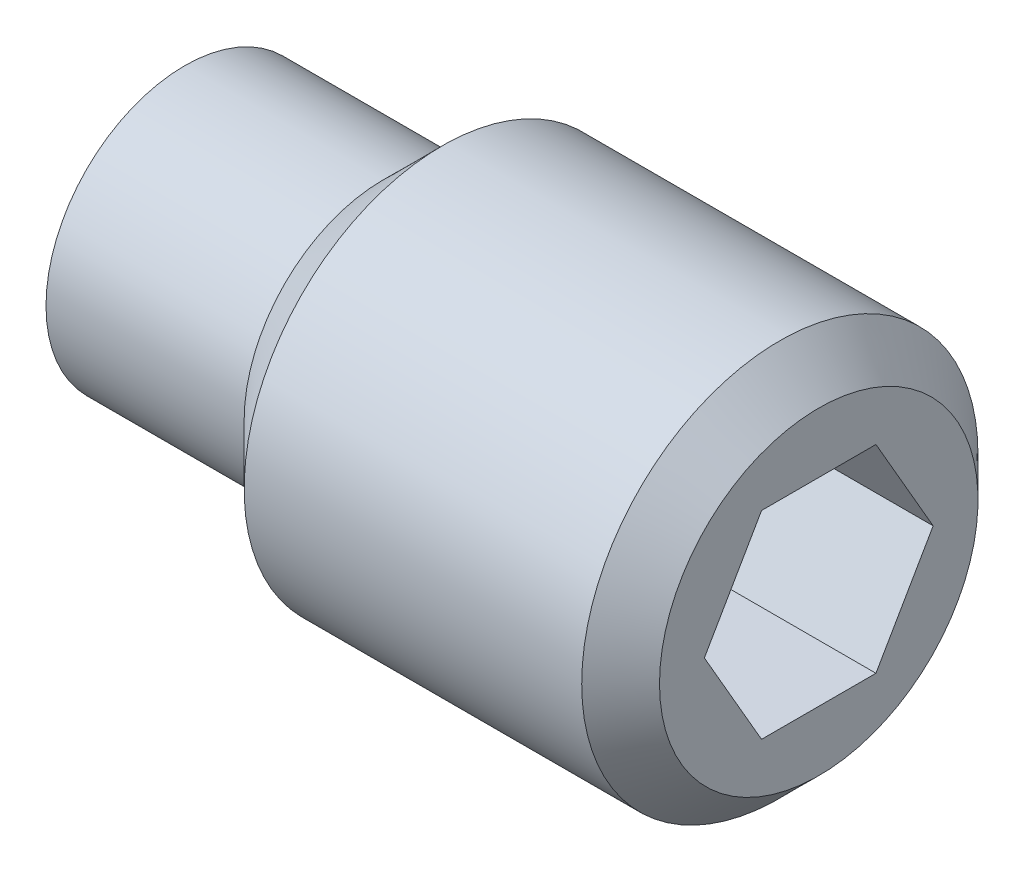
ISO-10303-21;
HEADER;
FILE_DESCRIPTION(('STEP AP214'),'2;1');
FILE_NAME('part.step','',(''),(''),'','','');
FILE_SCHEMA(('AUTOMOTIVE_DESIGN { 1 0 10303 214 1 1 1 1 }'));
ENDSEC;
DATA;
#1=APPLICATION_CONTEXT('core data for automotive mechanical design processes');
#2=APPLICATION_PROTOCOL_DEFINITION('international standard','automotive_design',2000,#1);
#3=PRODUCT_CONTEXT('',#1,'mechanical');
#4=PRODUCT('Part','Part','',(#3));
#5=PRODUCT_RELATED_PRODUCT_CATEGORY('part','',(#4));
#6=PRODUCT_DEFINITION_FORMATION('','',#4);
#7=PRODUCT_DEFINITION_CONTEXT('part definition',#1,'design');
#8=PRODUCT_DEFINITION('design','',#6,#7);
#9=PRODUCT_DEFINITION_SHAPE('','',#8);
#10=(LENGTH_UNIT() NAMED_UNIT(*) SI_UNIT(.MILLI.,.METRE.));
#11=(NAMED_UNIT(*) PLANE_ANGLE_UNIT() SI_UNIT($,.RADIAN.));
#12=(NAMED_UNIT(*) SI_UNIT($,.STERADIAN.) SOLID_ANGLE_UNIT());
#13=UNCERTAINTY_MEASURE_WITH_UNIT(LENGTH_MEASURE(1.E-05),#10,'distance_accuracy_value','');
#14=(GEOMETRIC_REPRESENTATION_CONTEXT(3) GLOBAL_UNCERTAINTY_ASSIGNED_CONTEXT((#13)) GLOBAL_UNIT_ASSIGNED_CONTEXT((#10,
#11,#12)) REPRESENTATION_CONTEXT('',''));
#15=CARTESIAN_POINT('',(0.,0.,0.));
#16=DIRECTION('',(0.,0.,1.));
#17=DIRECTION('',(1.,0.,0.));
#18=AXIS2_PLACEMENT_3D('',#15,#16,#17);
#19=CARTESIAN_POINT('',(8.,-1.25,0.721687836487));
#20=DIRECTION('',(0.,-1.,0.));
#21=DIRECTION('',(0.,0.,-1.));
#22=AXIS2_PLACEMENT_3D('',#19,#20,#21);
#23=PLANE('',#22);
#24=CARTESIAN_POINT('',(5.00000000001904,-1.25,0.721687836479526));
#25=CARTESIAN_POINT('',(4.98289611115972,-1.24999999474163,0.662444421513435));
#26=CARTESIAN_POINT('',(4.96723701410208,-1.2499999973679,0.602732338649849));
#27=CARTESIAN_POINT('',(4.93956150219575,-1.25000000263793,0.482338189538206));
#28=CARTESIAN_POINT('',(4.9275532377462,-1.2500000052817,0.421654266781865));
#29=CARTESIAN_POINT('',(4.90824250364097,-1.24999999484114,0.300967350633981));
#30=CARTESIAN_POINT('',(4.90083707686526,-1.2499999821212,0.240981349023029));
#31=CARTESIAN_POINT('',(4.89089570036484,-1.25000001785936,0.120663266810707));
#32=CARTESIAN_POINT('',(4.88835446491729,-1.25000006625096,0.0603316334074688));
#33=CARTESIAN_POINT('',(4.88835446491709,-1.25000006625096,-0.0603316333998728));
#34=CARTESIAN_POINT('',(4.8908957003645,-1.25000001785936,-0.120663266803977));
#35=CARTESIAN_POINT('',(4.90083707686463,-1.2499999821212,-0.240981349018096));
#36=CARTESIAN_POINT('',(4.90824250364019,-1.24999999484114,-0.300967350629978));
#37=CARTESIAN_POINT('',(4.92755323774597,-1.2500000052817,-0.421654266779554));
#38=CARTESIAN_POINT('',(4.93956150219624,-1.25000000263793,-0.482338189536651));
#39=CARTESIAN_POINT('',(4.96723701410138,-1.2499999973679,-0.60273233865044));
#40=CARTESIAN_POINT('',(4.98289611115711,-1.24999999474163,-0.662444421515415));
#41=CARTESIAN_POINT('',(5.0000000000115,-1.25,-0.721687836483682));
#42=B_SPLINE_CURVE_WITH_KNOTS('',3,(#24,#25,#26,#27,#28,#29,#30,#31,#32,#33,#34,#35,#36,#37,#38,
#39,#40,#41),.UNSPECIFIED.,.F.,.F.,(4,2,2,2,2,2,2,2,4),(0.,0.185045871712566,0.370501870824418,
0.551644291487993,0.732589759905811,0.913535228326233,1.09467764899245,1.28013364810704,
1.4651795198222),.UNSPECIFIED.);
#43=CARTESIAN_POINT('',(5.00000000001842,-1.24999999999682,0.7216878364829));
#44=VERTEX_POINT('',#43);
#45=CARTESIAN_POINT('',(5.00000000001198,-1.25,-0.721687836485341));
#46=VERTEX_POINT('',#45);
#47=EDGE_CURVE('E21',#44,#46,#42,.T.);
#48=ORIENTED_EDGE('',*,*,#47,.F.);
#49=DIRECTION('',(1.,0.,0.));
#50=VECTOR('',#49,1.);
#51=CARTESIAN_POINT('',(8.,-1.2499999999981,0.721687836483704));
#52=LINE('',#51,#50);
#53=CARTESIAN_POINT('',(8.,-1.24999999999873,0.721687836484802));
#54=VERTEX_POINT('',#53);
#55=EDGE_CURVE('E85',#44,#54,#52,.T.);
#56=ORIENTED_EDGE('',*,*,#55,.T.);
#57=DIRECTION('',(0.,0.,-1.));
#58=VECTOR('',#57,1.);
#59=CARTESIAN_POINT('',(8.,-1.25,0.721687836487));
#60=LINE('',#59,#58);
#61=CARTESIAN_POINT('',(8.,-1.25,-0.721687836487));
#62=VERTEX_POINT('',#61);
#63=EDGE_CURVE('E86',#62,#54,#60,.F.);
#64=ORIENTED_EDGE('',*,*,#63,.F.);
#65=DIRECTION('',(1.,0.,0.));
#66=VECTOR('',#65,1.);
#67=CARTESIAN_POINT('',(8.,-1.25,-0.721687836487));
#68=LINE('',#67,#66);
#69=EDGE_CURVE('E89',#62,#46,#68,.F.);
#70=ORIENTED_EDGE('',*,*,#69,.T.);
#71=EDGE_LOOP('',(#48,#56,#64,#70));
#72=FACE_BOUND('',#71,.T.);
#73=ADVANCED_FACE('F17',(#72),#23,.F.);
#74=CARTESIAN_POINT('',(8.,0.,1.44337567297));
#75=DIRECTION('',(0.,-0.50000000000019,0.866025403784329));
#76=DIRECTION('',(0.,-0.866025403784329,-0.50000000000019));
#77=AXIS2_PLACEMENT_3D('',#74,#75,#76);
#78=PLANE('',#77);
#79=DIRECTION('',(1.,0.,0.));
#80=VECTOR('',#79,1.);
#81=CARTESIAN_POINT('',(8.,1.90060640836709E-12,1.4433756729733));
#82=LINE('',#81,#80);
#83=CARTESIAN_POINT('',(5.00000000001857,-2.78732666403681E-12,1.44337567296949));
#84=VERTEX_POINT('',#83);
#85=CARTESIAN_POINT('',(8.,1.26558326683197E-12,1.4433756729722));
#86=VERTEX_POINT('',#85);
#87=EDGE_CURVE('E97',#84,#86,#82,.T.);
#88=ORIENTED_EDGE('',*,*,#87,.T.);
#89=DIRECTION('',(0.,-0.866025403784329,-0.50000000000019));
#90=VECTOR('',#89,1.);
#91=CARTESIAN_POINT('',(8.,0.,1.44337567297));
#92=LINE('',#91,#90);
#93=EDGE_CURVE('E202',#54,#86,#92,.F.);
#94=ORIENTED_EDGE('',*,*,#93,.F.);
#95=ORIENTED_EDGE('',*,*,#55,.F.);
#96=CARTESIAN_POINT('',(5.00000000001588,-7.75612856317836E-12,1.44337567296645));
#97=CARTESIAN_POINT('',(4.98168471572059,-0.0549299297341489,1.41166186325174));
#98=CARTESIAN_POINT('',(4.96502792320445,-0.110334013832605,1.37967430038303));
#99=CARTESIAN_POINT('',(4.93595399214256,-0.222101466684948,1.31514533139188));
#100=CARTESIAN_POINT('',(4.92354713772891,-0.278466820683721,1.28260277908777));
#101=CARTESIAN_POINT('',(4.90423497435936,-0.390499021104487,1.21792095801695));
#102=CARTESIAN_POINT('',(4.89720111726636,-0.446148634765127,1.18579163858965));
#103=CARTESIAN_POINT('',(4.88880573010025,-0.557709575292939,1.12138189954482));
#104=CARTESIAN_POINT('',(4.88743724625279,-0.613620496944659,1.08910171387855));
#105=CARTESIAN_POINT('',(4.89029143136597,-0.718084056071275,1.02878964989626));
#106=CARTESIAN_POINT('',(4.89381330327945,-0.766652369154264,1.0007487212637));
#107=CARTESIAN_POINT('',(4.90497331296815,-0.863472588603186,0.944849541501837));
#108=CARTESIAN_POINT('',(4.91261525924967,-0.91172416034378,0.916991483568569));
#109=CARTESIAN_POINT('',(4.93171864585547,-1.0087438385756,0.860977146224707));
#110=CARTESIAN_POINT('',(4.94326102640528,-1.05749967211165,0.832827952608094));
#111=CARTESIAN_POINT('',(4.96945735054298,-1.15428435624833,0.776949289168319));
#112=CARTESIAN_POINT('',(4.98410514298824,-1.20231444581616,0.749219104027117));
#113=CARTESIAN_POINT('',(5.00000000001781,-1.24999999999364,0.721687836486274));
#114=B_SPLINE_CURVE_WITH_KNOTS('',3,(#96,#97,#98,#99,#100,#101,#102,#103,#104,#105,#106,#107,
#108,#109,#110,#111,#112,#113),.UNSPECIFIED.,.F.,.F.,(4,2,2,2,2,2,2,2,4),(0.,0.198135007221789,
0.396746135639453,0.590442253841928,0.783900555556332,0.952317364137337,1.12089012111111,
1.29320101404209,1.4651737334306),.UNSPECIFIED.);
#115=EDGE_CURVE('E81',#84,#44,#114,.T.);
#116=ORIENTED_EDGE('',*,*,#115,.F.);
#117=EDGE_LOOP('',(#88,#94,#95,#116));
#118=FACE_BOUND('',#117,.T.);
#119=ADVANCED_FACE('F240',(#118),#78,.F.);
#120=CARTESIAN_POINT('',(8.,-1.25,-0.721687836487));
#121=DIRECTION('',(0.,-0.50000000000019,-0.866025403784329));
#122=DIRECTION('',(0.,0.866025403784329,-0.50000000000019));
#123=AXIS2_PLACEMENT_3D('',#120,#121,#122);
#124=PLANE('',#123);
#125=ORIENTED_EDGE('',*,*,#69,.F.);
#126=DIRECTION('',(0.,0.866025403784329,-0.50000000000019));
#127=VECTOR('',#126,1.);
#128=CARTESIAN_POINT('',(8.,-1.25,-0.721687836487));
#129=LINE('',#128,#127);
#130=CARTESIAN_POINT('',(8.,5.94495953870982E-11,-1.44337567295029));
#131=VERTEX_POINT('',#130);
#132=EDGE_CURVE('E92',#131,#62,#129,.F.);
#133=ORIENTED_EDGE('',*,*,#132,.F.);
#134=DIRECTION('',(1.,0.,0.));
#135=VECTOR('',#134,1.);
#136=CARTESIAN_POINT('',(8.,7.21007828594992E-11,-1.44337567292837));
#137=LINE('',#136,#135);
#138=CARTESIAN_POINT('',(4.99999999615965,-1.14831157136668E-08,-1.44337566630079));
#139=VERTEX_POINT('',#138);
#140=EDGE_CURVE('E95',#131,#139,#137,.F.);
#141=ORIENTED_EDGE('',*,*,#140,.T.);
#142=CARTESIAN_POINT('',(5.0000000000115,-1.24999999999713,-0.72168783648866));
#143=CARTESIAN_POINT('',(4.98168471571867,-1.19507007027865,-0.753401646198206));
#144=CARTESIAN_POINT('',(4.96502792320468,-1.13966598618833,-0.785389209061972));
#145=CARTESIAN_POINT('',(4.9359539921461,-1.02789853335369,-0.849918178042721));
#146=CARTESIAN_POINT('',(4.9235471377335,-0.971533179364507,-0.882460730341363));
#147=CARTESIAN_POINT('',(4.90423497436065,-0.859500978944825,-0.947142551411605));
#148=CARTESIAN_POINT('',(4.897201117265,-0.803851365275455,-0.97927187084393));
#149=CARTESIAN_POINT('',(4.88880573009561,-0.692290424728642,-1.04368160989971));
#150=CARTESIAN_POINT('',(4.88743724624761,-0.636379503066647,-1.07596179557192));
#151=CARTESIAN_POINT('',(4.89029143130092,-0.531915946094037,-1.1362738583106));
#152=CARTESIAN_POINT('',(4.89381330295911,-0.48334763517069,-1.16431478569629));
#153=CARTESIAN_POINT('',(4.90497331178614,-0.386527420005154,-1.22021396298514));
#154=CARTESIAN_POINT('',(4.91261525746046,-0.338275850388219,-1.24807201969231));
#155=CARTESIAN_POINT('',(4.93171864255231,-0.241256176452876,-1.3040863545556));
#156=CARTESIAN_POINT('',(4.94326102218439,-0.192500345087545,-1.33223554691895));
#157=CARTESIAN_POINT('',(4.96945734428709,-0.0957156652132834,-1.38811420789782));
#158=CARTESIAN_POINT('',(4.98410513561629,-0.0476855777374497,-1.4158443918312));
#159=CARTESIAN_POINT('',(4.99999999147179,-2.56226147036494E-08,-1.44337565818117));
#160=B_SPLINE_CURVE_WITH_KNOTS('',3,(#142,#143,#144,#145,#146,#147,#148,#149,#150,#151,#152,
#153,#154,#155,#156,#157,#158,#159),.UNSPECIFIED.,.F.,.F.,(4,2,2,2,2,2,2,2,4),(0.,
0.198135007192567,0.396746135577147,0.590442253810806,0.783900555559192,0.952317356648343,
1.12089010610254,1.29320099112337,1.46517370266198),.UNSPECIFIED.);
#161=EDGE_CURVE('E79',#46,#139,#160,.T.);
#162=ORIENTED_EDGE('',*,*,#161,.F.);
#163=EDGE_LOOP('',(#125,#133,#141,#162));
#164=FACE_BOUND('',#163,.T.);
#165=ADVANCED_FACE('F94',(#164),#124,.F.);
#166=CARTESIAN_POINT('',(8.,1.25,0.721687836487));
#167=DIRECTION('',(0.,0.50000000000019,0.866025403784329));
#168=DIRECTION('',(0.,-0.866025403784329,0.50000000000019));
#169=AXIS2_PLACEMENT_3D('',#166,#167,#168);
#170=PLANE('',#169);
#171=DIRECTION('',(1.,0.,0.));
#172=VECTOR('',#171,1.);
#173=CARTESIAN_POINT('',(8.,1.25,0.721687836487));
#174=LINE('',#173,#172);
#175=CARTESIAN_POINT('',(4.99999999232941,1.24999996249412,0.721687874803954));
#176=VERTEX_POINT('',#175);
#177=CARTESIAN_POINT('',(8.,1.25000000007187,0.721687836459937));
#178=VERTEX_POINT('',#177);
#179=EDGE_CURVE('E136',#176,#178,#174,.T.);
#180=ORIENTED_EDGE('',*,*,#179,.T.);
#181=DIRECTION('',(0.,-0.866025403784329,0.50000000000019));
#182=VECTOR('',#181,1.);
#183=CARTESIAN_POINT('',(8.,1.25,0.721687836487));
#184=LINE('',#183,#182);
#185=EDGE_CURVE('E100',#86,#178,#184,.F.);
#186=ORIENTED_EDGE('',*,*,#185,.F.);
#187=ORIENTED_EDGE('',*,*,#87,.F.);
#188=CARTESIAN_POINT('',(5.00000000001821,1.06156038532429E-11,1.44337567296744));
#189=CARTESIAN_POINT('',(4.98168471573036,0.0549299297131753,1.41166186326761));
#190=CARTESIAN_POINT('',(4.96502792322067,0.110334013787289,1.37967430041342));
#191=CARTESIAN_POINT('',(4.93595399216867,0.222101466586891,1.31514533145306));
#192=CARTESIAN_POINT('',(4.92354713775819,0.278466820557217,1.28260277916525));
#193=CARTESIAN_POINT('',(4.90423497437942,0.390499020973991,1.21792095809664));
#194=CARTESIAN_POINT('',(4.89720111727898,0.446148634659747,1.18579163865487));
#195=CARTESIAN_POINT('',(4.88880573010404,0.557709575242294,1.12138189957847));
#196=CARTESIAN_POINT('',(4.88743724625542,0.613620496923643,1.08910171389508));
#197=CARTESIAN_POINT('',(4.89029143119425,0.71808404974184,1.02878965355496));
#198=CARTESIAN_POINT('',(4.89381330236064,0.766652356500373,1.00074872857382));
#199=CARTESIAN_POINT('',(4.90497330952715,0.863472563405467,0.944849556054143));
#200=CARTESIAN_POINT('',(4.91261525403113,0.911724128926938,0.916991501711486));
#201=CARTESIAN_POINT('',(4.93171863620473,1.00874379457656,0.860977171631959));
#202=CARTESIAN_POINT('',(4.94326101406775,1.05749962175571,0.832827981685504));
#203=CARTESIAN_POINT('',(4.96945733224751,1.15428429340989,0.776949325452503));
#204=CARTESIAN_POINT('',(4.98410512142518,1.20231437685128,0.749219143848402));
#205=CARTESIAN_POINT('',(4.99999997501728,1.24999992498824,0.721687879795058));
#206=B_SPLINE_CURVE_WITH_KNOTS('',3,(#188,#189,#190,#191,#192,#193,#194,#195,#196,#197,#198,
#199,#200,#201,#202,#203,#204,#205),.UNSPECIFIED.,.F.,.F.,(4,2,2,2,2,2,2,2,4),(0.,
0.198135007134762,0.39674613545411,0.590442253746268,0.783900555558537,0.952317342199931,
1.12089007715292,1.29320094691959,1.46517364332018),.UNSPECIFIED.);
#207=EDGE_CURVE('E131',#84,#176,#206,.T.);
#208=ORIENTED_EDGE('',*,*,#207,.T.);
#209=EDGE_LOOP('',(#180,#186,#187,#208));
#210=FACE_BOUND('',#209,.T.);
#211=ADVANCED_FACE('F127',(#210),#170,.F.);
#212=CARTESIAN_POINT('',(8.,0.,-1.44337567297));
#213=DIRECTION('',(0.,0.50000000000019,-0.866025403784329));
#214=DIRECTION('',(0.,0.866025403784329,0.50000000000019));
#215=AXIS2_PLACEMENT_3D('',#212,#213,#214);
#216=PLANE('',#215);
#217=ORIENTED_EDGE('',*,*,#140,.F.);
#218=DIRECTION('',(0.,0.866025403784329,0.50000000000019));
#219=VECTOR('',#218,1.);
#220=CARTESIAN_POINT('',(8.,0.,-1.44337567297));
#221=LINE('',#220,#219);
#222=CARTESIAN_POINT('',(8.,1.25000000006163,-0.721687836422151));
#223=VERTEX_POINT('',#222);
#224=EDGE_CURVE('E40',#223,#131,#221,.F.);
#225=ORIENTED_EDGE('',*,*,#224,.F.);
#226=DIRECTION('',(1.,0.,0.));
#227=VECTOR('',#226,1.);
#228=CARTESIAN_POINT('',(8.,1.25,-0.721687836402));
#229=LINE('',#228,#227);
#230=CARTESIAN_POINT('',(5.00000000001145,1.2500000000357,-0.72168783642169));
#231=VERTEX_POINT('',#230);
#232=EDGE_CURVE('E145',#223,#231,#229,.F.);
#233=ORIENTED_EDGE('',*,*,#232,.T.);
#234=CARTESIAN_POINT('',(5.00000000003499,1.2500000000714,-0.72168783644138));
#235=CARTESIAN_POINT('',(4.98168471573981,1.19507007035099,-0.753401646152046));
#236=CARTESIAN_POINT('',(4.9650279232234,1.13966598625871,-0.785389209016942));
#237=CARTESIAN_POINT('',(4.93595399215986,1.02789853341991,-0.849918178000095));
#238=CARTESIAN_POINT('',(4.92354713774477,0.971533179428513,-0.882460730300013));
#239=CARTESIAN_POINT('',(4.90423497436746,0.859500979006175,-0.947142551371789));
#240=CARTESIAN_POINT('',(4.89720111726968,0.803851365336389,-0.979271870804355));
#241=CARTESIAN_POINT('',(4.88880573009597,0.692290424788727,-1.04368160986063));
#242=CARTESIAN_POINT('',(4.88743724624577,0.6363795031263,-1.07596179553309));
#243=CARTESIAN_POINT('',(4.89029143130119,0.531915945936646,-1.13627385839707));
#244=CARTESIAN_POINT('',(4.89381330298312,0.483347634797166,-1.16431478590755));
#245=CARTESIAN_POINT('',(4.90497331189292,0.386527419202858,-1.22021396344395));
#246=CARTESIAN_POINT('',(4.91261525762635,0.338275849373291,-1.24807202027388));
#247=CARTESIAN_POINT('',(4.93171864286662,0.241256175007699,-1.30408635538558));
#248=CARTESIAN_POINT('',(4.9432610225891,0.192500343424961,-1.33223554787445));
#249=CARTESIAN_POINT('',(4.96945734489283,0.0957156631237688,-1.3881142090998));
#250=CARTESIAN_POINT('',(4.98410513633254,0.0476855754383835,-1.41584439315418));
#251=CARTESIAN_POINT('',(4.99999999230447,2.31169454011823E-08,-1.44337565962343));
#252=B_SPLINE_CURVE_WITH_KNOTS('',3,(#234,#235,#236,#237,#238,#239,#240,#241,#242,#243,#244,
#245,#246,#247,#248,#249,#250,#251),.UNSPECIFIED.,.F.,.F.,(4,2,2,2,2,2,2,2,4),(0.,
0.198135007200973,0.396746135594491,0.590442253830258,0.783900555580421,0.952317357418995,
1.12089010762539,1.29320099343754,1.46517370576145),.UNSPECIFIED.);
#253=EDGE_CURVE('E107',#231,#139,#252,.T.);
#254=ORIENTED_EDGE('',*,*,#253,.T.);
#255=EDGE_LOOP('',(#217,#225,#233,#254));
#256=FACE_BOUND('',#255,.T.);
#257=ADVANCED_FACE('F122',(#256),#216,.F.);
#258=CARTESIAN_POINT('',(5.00499999998283,0.,0.));
#259=DIRECTION('',(1.,0.,0.));
#260=DIRECTION('',(0.,0.,-1.));
#261=AXIS2_PLACEMENT_3D('',#258,#259,#260);
#262=CONICAL_SURFACE('',#261,1.45203592694543,1.04719755119609);
#263=CARTESIAN_POINT('',(4.16666666671972,-5.6843418860808E-11,0.));
#264=VERTEX_POINT('',#263);
#265=VERTEX_LOOP('',#264);
#266=FACE_BOUND('',#265,.T.);
#267=ORIENTED_EDGE('',*,*,#207,.F.);
#268=ORIENTED_EDGE('',*,*,#115,.T.);
#269=ORIENTED_EDGE('',*,*,#47,.T.);
#270=ORIENTED_EDGE('',*,*,#161,.T.);
#271=ORIENTED_EDGE('',*,*,#253,.F.);
#272=CARTESIAN_POINT('',(4.99999999998868,1.25,-0.721687836404651));
#273=CARTESIAN_POINT('',(4.98289611114084,1.24999999474137,-0.662444421434606));
#274=CARTESIAN_POINT('',(4.96723701408848,1.24999999736777,-0.602732338568687));
#275=CARTESIAN_POINT('',(4.93956150218743,1.25000000263806,-0.482338189452175));
#276=CARTESIAN_POINT('',(4.92755323773796,1.25000000528197,-0.421654266693278));
#277=CARTESIAN_POINT('',(4.9082425036384,1.24999999484089,-0.300967350556852));
#278=CARTESIAN_POINT('',(4.90083707686699,1.24999998212031,-0.240981348960126));
#279=CARTESIAN_POINT('',(4.89089570037052,1.25000001786024,-0.120663266778309));
#280=CARTESIAN_POINT('',(4.88835446492254,1.25000006625424,-0.0603316333913596));
#281=CARTESIAN_POINT('',(4.8883544649232,1.25000006625424,0.0603316356578453));
#282=CARTESIAN_POINT('',(4.89089570056336,1.25000001786024,0.1206632713201));
#283=CARTESIAN_POINT('',(4.90083707779799,1.24999998212031,0.240981358014556));
#284=CARTESIAN_POINT('',(4.90824250511628,1.24999999484089,0.300967361848523));
#285=CARTESIAN_POINT('',(4.92755324060414,1.25000000528196,0.421654282498194));
#286=CARTESIAN_POINT('',(4.93956150590561,1.25000000263806,0.482338207530739));
#287=CARTESIAN_POINT('',(4.96723701970606,1.24999999736777,0.602732361103648));
#288=CARTESIAN_POINT('',(4.98289611780452,1.24999999474137,0.662444446152669));
#289=CARTESIAN_POINT('',(5.0000000077532,1.25,0.721687863271447));
#290=B_SPLINE_CURVE_WITH_KNOTS('',3,(#272,#273,#274,#275,#276,#277,#278,#279,#280,#281,#282,
#283,#284,#285,#286,#287,#288,#289),.UNSPECIFIED.,.F.,.F.,(4,2,2,2,2,2,2,2,4),(0.,
0.185045871715306,0.370501870834809,0.551644291454247,0.732589759824679,0.913535235013019,
1.09467766247698,1.280133668774,1.46517954760778),.UNSPECIFIED.);
#291=EDGE_CURVE('E137',#231,#176,#290,.T.);
#292=ORIENTED_EDGE('',*,*,#291,.T.);
#293=EDGE_LOOP('',(#267,#268,#269,#270,#271,#292));
#294=FACE_BOUND('',#293,.T.);
#295=ADVANCED_FACE('F76',(#266,#294),#262,.F.);
#296=CARTESIAN_POINT('',(0.,0.875,0.));
#297=DIRECTION('',(-1.,0.,0.));
#298=DIRECTION('',(0.,-1.,0.));
#299=AXIS2_PLACEMENT_3D('',#296,#297,#298);
#300=PLANE('',#299);
#301=CARTESIAN_POINT('',(0.,0.,0.));
#302=DIRECTION('',(1.,0.,0.));
#303=DIRECTION('',(0.,0.,-1.));
#304=AXIS2_PLACEMENT_3D('',#301,#302,#303);
#305=CIRCLE('',#304,1.75);
#306=CARTESIAN_POINT('',(0.,0.,-1.75));
#307=VERTEX_POINT('',#306);
#308=EDGE_CURVE('E144',#307,#307,#305,.T.);
#309=ORIENTED_EDGE('',*,*,#308,.F.);
#310=EDGE_LOOP('',(#309));
#311=FACE_BOUND('',#310,.T.);
#312=ADVANCED_FACE('F152',(#311),#300,.T.);
#313=CARTESIAN_POINT('',(8.,1.25,-0.721687836487));
#314=DIRECTION('',(0.,1.,0.));
#315=DIRECTION('',(0.,0.,1.));
#316=AXIS2_PLACEMENT_3D('',#313,#314,#315);
#317=PLANE('',#316);
#318=ORIENTED_EDGE('',*,*,#291,.F.);
#319=ORIENTED_EDGE('',*,*,#232,.F.);
#320=DIRECTION('',(0.,0.,1.));
#321=VECTOR('',#320,1.);
#322=CARTESIAN_POINT('',(8.,1.25000000015,0.));
#323=LINE('',#322,#321);
#324=EDGE_CURVE('E194',#223,#178,#323,.T.);
#325=ORIENTED_EDGE('',*,*,#324,.T.);
#326=ORIENTED_EDGE('',*,*,#179,.F.);
#327=EDGE_LOOP('',(#318,#319,#325,#326));
#328=FACE_BOUND('',#327,.T.);
#329=ADVANCED_FACE('F147',(#328),#317,.F.);
#330=CARTESIAN_POINT('',(1.25,0.,0.));
#331=DIRECTION('',(1.,0.,0.));
#332=DIRECTION('',(0.,0.,-1.));
#333=AXIS2_PLACEMENT_3D('',#330,#331,#332);
#334=CYLINDRICAL_SURFACE('',#333,1.75);
#335=ORIENTED_EDGE('',*,*,#308,.T.);
#336=EDGE_LOOP('',(#335));
#337=FACE_BOUND('',#336,.T.);
#338=CARTESIAN_POINT('',(2.49999999999773,0.,0.));
#339=DIRECTION('',(1.,0.,0.));
#340=DIRECTION('',(0.,-1.,0.));
#341=AXIS2_PLACEMENT_3D('',#338,#339,#340);
#342=CIRCLE('',#341,1.75000000001546);
#343=CARTESIAN_POINT('',(2.49999999999773,-1.75000000001546,0.));
#344=VERTEX_POINT('',#343);
#345=EDGE_CURVE('E191',#344,#344,#342,.T.);
#346=ORIENTED_EDGE('',*,*,#345,.F.);
#347=EDGE_LOOP('',(#346));
#348=FACE_BOUND('',#347,.T.);
#349=ADVANCED_FACE('F151',(#337,#348),#334,.T.);
#350=CARTESIAN_POINT('',(8.,0.,0.));
#351=DIRECTION('',(-1.,0.,0.));
#352=DIRECTION('',(0.,-1.,0.));
#353=AXIS2_PLACEMENT_3D('',#350,#351,#352);
#354=PLANE('',#353);
#355=ORIENTED_EDGE('',*,*,#224,.T.);
#356=ORIENTED_EDGE('',*,*,#132,.T.);
#357=ORIENTED_EDGE('',*,*,#63,.T.);
#358=ORIENTED_EDGE('',*,*,#93,.T.);
#359=ORIENTED_EDGE('',*,*,#185,.T.);
#360=ORIENTED_EDGE('',*,*,#324,.F.);
#361=EDGE_LOOP('',(#355,#356,#357,#358,#359,#360));
#362=FACE_BOUND('',#361,.T.);
#363=CARTESIAN_POINT('',(8.00000000026557,0.,0.));
#364=DIRECTION('',(-1.,0.,0.));
#365=DIRECTION('',(0.,0.,1.));
#366=AXIS2_PLACEMENT_3D('',#363,#364,#365);
#367=CIRCLE('',#366,2.00923999977931);
#368=CARTESIAN_POINT('',(8.00000000026557,0.,2.00923999977931));
#369=VERTEX_POINT('',#368);
#370=EDGE_CURVE('E190',#369,#369,#367,.T.);
#371=ORIENTED_EDGE('',*,*,#370,.F.);
#372=EDGE_LOOP('',(#371));
#373=FACE_BOUND('',#372,.T.);
#374=ADVANCED_FACE('F178',(#362,#373),#354,.F.);
#375=CARTESIAN_POINT('',(3.24999999992315,0.,0.));
#376=DIRECTION('',(1.,0.,0.));
#377=DIRECTION('',(0.,0.,-1.));
#378=AXIS2_PLACEMENT_3D('',#375,#376,#377);
#379=CONICAL_SURFACE('',#378,2.49999999994088,0.785398163435344);
#380=CARTESIAN_POINT('',(3.25,0.,0.));
#381=DIRECTION('',(1.,0.,0.));
#382=DIRECTION('',(0.,0.,-1.));
#383=AXIS2_PLACEMENT_3D('',#380,#381,#382);
#384=CIRCLE('',#383,2.5);
#385=CARTESIAN_POINT('',(3.25,0.,-2.5));
#386=VERTEX_POINT('',#385);
#387=EDGE_CURVE('E31',#386,#386,#384,.T.);
#388=ORIENTED_EDGE('',*,*,#387,.F.);
#389=EDGE_LOOP('',(#388));
#390=FACE_BOUND('',#389,.T.);
#391=ORIENTED_EDGE('',*,*,#345,.T.);
#392=EDGE_LOOP('',(#391));
#393=FACE_BOUND('',#392,.T.);
#394=ADVANCED_FACE('F171',(#390,#393),#379,.T.);
#395=CARTESIAN_POINT('',(7.50923999981978,0.,0.));
#396=DIRECTION('',(-1.,0.,0.));
#397=DIRECTION('',(0.,0.,1.));
#398=AXIS2_PLACEMENT_3D('',#395,#396,#397);
#399=CONICAL_SURFACE('',#398,2.50000000016826,0.785398163339535);
#400=ORIENTED_EDGE('',*,*,#370,.T.);
#401=EDGE_LOOP('',(#400));
#402=FACE_BOUND('',#401,.T.);
#403=CARTESIAN_POINT('',(7.50923999958,0.,0.));
#404=DIRECTION('',(1.,0.,0.));
#405=DIRECTION('',(0.,0.,-1.));
#406=AXIS2_PLACEMENT_3D('',#403,#404,#405);
#407=CIRCLE('',#406,2.5);
#408=CARTESIAN_POINT('',(7.50923999958,0.,-2.5));
#409=VERTEX_POINT('',#408);
#410=EDGE_CURVE('E11',#409,#409,#407,.F.);
#411=ORIENTED_EDGE('',*,*,#410,.F.);
#412=EDGE_LOOP('',(#411));
#413=FACE_BOUND('',#412,.T.);
#414=ADVANCED_FACE('F165',(#402,#413),#399,.T.);
#415=CARTESIAN_POINT('',(5.25,0.,0.));
#416=DIRECTION('',(1.,0.,0.));
#417=DIRECTION('',(0.,0.,-1.));
#418=AXIS2_PLACEMENT_3D('',#415,#416,#417);
#419=CYLINDRICAL_SURFACE('',#418,2.5);
#420=ORIENTED_EDGE('',*,*,#387,.T.);
#421=EDGE_LOOP('',(#420));
#422=FACE_BOUND('',#421,.T.);
#423=ORIENTED_EDGE('',*,*,#410,.T.);
#424=EDGE_LOOP('',(#423));
#425=FACE_BOUND('',#424,.T.);
#426=ADVANCED_FACE('F163',(#422,#425),#419,.T.);
#427=CLOSED_SHELL('',(#73,#119,#165,#211,#257,#295,#312,#329,#349,#374,#394,#414,#426));
#428=MANIFOLD_SOLID_BREP('B1',#427);
#429=ADVANCED_BREP_SHAPE_REPRESENTATION('',(#18,#428),#14);
#430=SHAPE_DEFINITION_REPRESENTATION(#9,#429);
ENDSEC;
END-ISO-10303-21;
